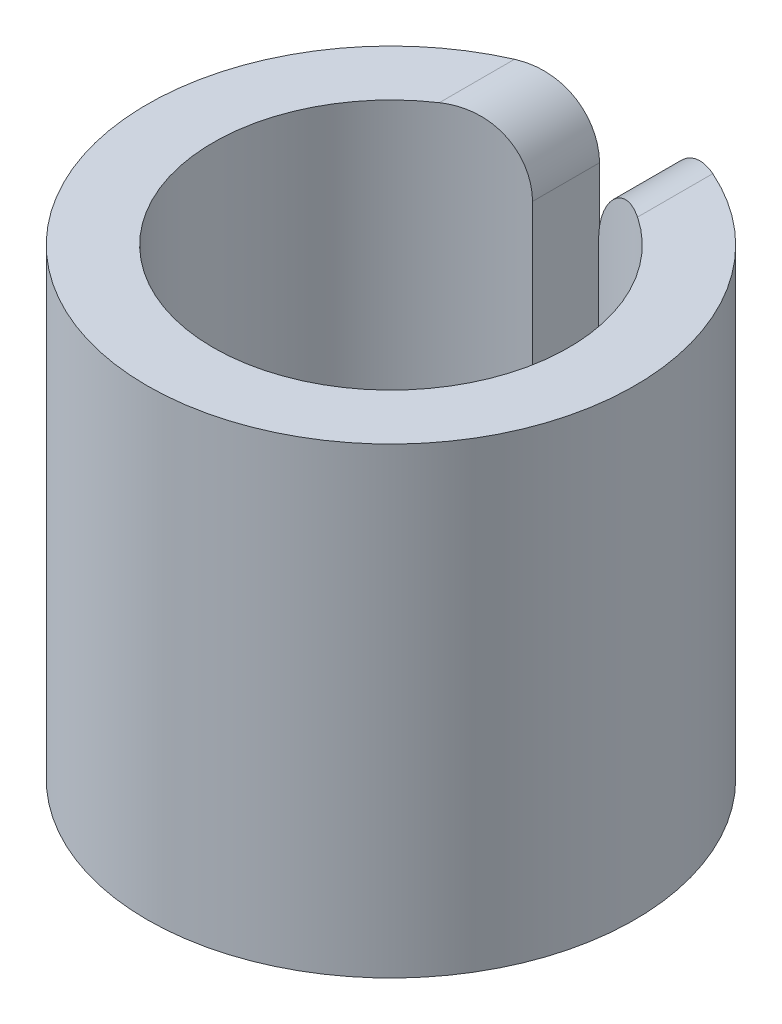
ISO-10303-21;
HEADER;
FILE_DESCRIPTION(('STEP AP214'),'2;1');
FILE_NAME('part.step','',(''),(''),'','','');
FILE_SCHEMA(('AUTOMOTIVE_DESIGN { 1 0 10303 214 1 1 1 1 }'));
ENDSEC;
DATA;
#1=APPLICATION_CONTEXT('core data for automotive mechanical design processes');
#2=APPLICATION_PROTOCOL_DEFINITION('international standard','automotive_design',2000,#1);
#3=PRODUCT_CONTEXT('',#1,'mechanical');
#4=PRODUCT('Part','Part','',(#3));
#5=PRODUCT_RELATED_PRODUCT_CATEGORY('part','',(#4));
#6=PRODUCT_DEFINITION_FORMATION('','',#4);
#7=PRODUCT_DEFINITION_CONTEXT('part definition',#1,'design');
#8=PRODUCT_DEFINITION('design','',#6,#7);
#9=PRODUCT_DEFINITION_SHAPE('','',#8);
#10=(LENGTH_UNIT() NAMED_UNIT(*) SI_UNIT(.MILLI.,.METRE.));
#11=(NAMED_UNIT(*) PLANE_ANGLE_UNIT() SI_UNIT($,.RADIAN.));
#12=(NAMED_UNIT(*) SI_UNIT($,.STERADIAN.) SOLID_ANGLE_UNIT());
#13=UNCERTAINTY_MEASURE_WITH_UNIT(LENGTH_MEASURE(1.E-05),#10,'distance_accuracy_value','');
#14=(GEOMETRIC_REPRESENTATION_CONTEXT(3) GLOBAL_UNCERTAINTY_ASSIGNED_CONTEXT((#13)) GLOBAL_UNIT_ASSIGNED_CONTEXT((#10,
#11,#12)) REPRESENTATION_CONTEXT('',''));
#15=CARTESIAN_POINT('',(0.,0.,0.));
#16=DIRECTION('',(0.,0.,1.));
#17=DIRECTION('',(1.,0.,0.));
#18=AXIS2_PLACEMENT_3D('',#15,#16,#17);
#19=CARTESIAN_POINT('',(0.,3.5,0.));
#20=DIRECTION('',(0.,1.,0.));
#21=DIRECTION('',(0.,0.,1.));
#22=AXIS2_PLACEMENT_3D('',#19,#20,#21);
#23=PLANE('',#22);
#24=CARTESIAN_POINT('',(0.,3.5,0.));
#25=DIRECTION('',(0.,1.,0.));
#26=DIRECTION('',(1.,0.,0.));
#27=AXIS2_PLACEMENT_3D('',#24,#25,#26);
#28=CIRCLE('',#27,3.69);
#29=CARTESIAN_POINT('',(-1.50000000000031,3.5,-3.37136470883811));
#30=VERTEX_POINT('',#29);
#31=CARTESIAN_POINT('',(1.5000000000003,3.5,-3.37136470883811));
#32=VERTEX_POINT('',#31);
#33=EDGE_CURVE('E227',#30,#32,#28,.T.);
#34=ORIENTED_EDGE('',*,*,#33,.T.);
#35=DIRECTION('',(0.,0.,-1.));
#36=VECTOR('',#35,1.);
#37=CARTESIAN_POINT('',(1.5000000000003,3.5,-2.64312315263586));
#38=LINE('',#37,#36);
#39=CARTESIAN_POINT('',(1.5000000000003,3.5,-2.23295767984955));
#40=VERTEX_POINT('',#39);
#41=EDGE_CURVE('E137',#32,#40,#38,.F.);
#42=ORIENTED_EDGE('',*,*,#41,.T.);
#43=CARTESIAN_POINT('',(0.,3.5,0.));
#44=DIRECTION('',(0.,1.,0.));
#45=DIRECTION('',(0.,0.,1.));
#46=AXIS2_PLACEMENT_3D('',#43,#44,#45);
#47=CIRCLE('',#46,2.69);
#48=CARTESIAN_POINT('',(-1.50000000000031,3.5,-2.23295767984955));
#49=VERTEX_POINT('',#48);
#50=EDGE_CURVE('E231',#49,#40,#47,.T.);
#51=ORIENTED_EDGE('',*,*,#50,.F.);
#52=DIRECTION('',(0.,0.,1.));
#53=VECTOR('',#52,1.);
#54=CARTESIAN_POINT('',(-1.50000000000031,3.5,-3.65596772414633));
#55=LINE('',#54,#53);
#56=EDGE_CURVE('E143',#49,#30,#55,.F.);
#57=ORIENTED_EDGE('',*,*,#56,.T.);
#58=EDGE_LOOP('',(#34,#42,#51,#57));
#59=FACE_BOUND('',#58,.T.);
#60=ADVANCED_FACE('F42',(#59),#23,.T.);
#61=CARTESIAN_POINT('',(0.,-3.5,0.));
#62=DIRECTION('',(0.,1.,0.));
#63=DIRECTION('',(0.,0.,1.));
#64=AXIS2_PLACEMENT_3D('',#61,#62,#63);
#65=PLANE('',#64);
#66=CARTESIAN_POINT('',(0.,-3.5,0.));
#67=DIRECTION('',(0.,1.,0.));
#68=DIRECTION('',(1.,0.,0.));
#69=AXIS2_PLACEMENT_3D('',#66,#67,#68);
#70=CIRCLE('',#69,3.69);
#71=CARTESIAN_POINT('',(-1.50000000000031,-3.5,-3.37136470883811));
#72=VERTEX_POINT('',#71);
#73=CARTESIAN_POINT('',(1.5000000000003,-3.5,-3.37136470883811));
#74=VERTEX_POINT('',#73);
#75=EDGE_CURVE('E228',#72,#74,#70,.T.);
#76=ORIENTED_EDGE('',*,*,#75,.F.);
#77=DIRECTION('',(0.,0.,1.));
#78=VECTOR('',#77,1.);
#79=CARTESIAN_POINT('',(-1.50000000000031,-3.5,0.));
#80=LINE('',#79,#78);
#81=CARTESIAN_POINT('',(-1.50000000000031,-3.5,-2.23295767984955));
#82=VERTEX_POINT('',#81);
#83=EDGE_CURVE('E12',#72,#82,#80,.T.);
#84=ORIENTED_EDGE('',*,*,#83,.T.);
#85=CARTESIAN_POINT('',(0.,-3.5,0.));
#86=DIRECTION('',(0.,1.,0.));
#87=DIRECTION('',(0.,0.,1.));
#88=AXIS2_PLACEMENT_3D('',#85,#86,#87);
#89=CIRCLE('',#88,2.69);
#90=CARTESIAN_POINT('',(1.5000000000003,-3.5,-2.23295767984955));
#91=VERTEX_POINT('',#90);
#92=EDGE_CURVE('E235',#82,#91,#89,.T.);
#93=ORIENTED_EDGE('',*,*,#92,.T.);
#94=DIRECTION('',(0.,0.,-1.));
#95=VECTOR('',#94,1.);
#96=CARTESIAN_POINT('',(1.50000000000031,-3.5,0.));
#97=LINE('',#96,#95);
#98=EDGE_CURVE('E52',#91,#74,#97,.T.);
#99=ORIENTED_EDGE('',*,*,#98,.T.);
#100=EDGE_LOOP('',(#76,#84,#93,#99));
#101=FACE_BOUND('',#100,.T.);
#102=ADVANCED_FACE('F211',(#101),#65,.F.);
#103=CARTESIAN_POINT('',(0.,3.5,0.));
#104=DIRECTION('',(0.,-1.,0.));
#105=DIRECTION('',(0.,0.,-1.));
#106=AXIS2_PLACEMENT_3D('',#103,#104,#105);
#107=CYLINDRICAL_SURFACE('',#106,3.69);
#108=DIRECTION('',(0.,-1.,0.));
#109=VECTOR('',#108,1.);
#110=CARTESIAN_POINT('',(0.500000000000304,3.5,-3.65596772414633));
#111=LINE('',#110,#109);
#112=CARTESIAN_POINT('',(0.500000000000304,-2.5,-3.65596772414633));
#113=VERTEX_POINT('',#112);
#114=CARTESIAN_POINT('',(0.500000000000304,2.5,-3.65596772414633));
#115=VERTEX_POINT('',#114);
#116=EDGE_CURVE('E119',#113,#115,#111,.F.);
#117=ORIENTED_EDGE('',*,*,#116,.T.);
#118=CARTESIAN_POINT('',(0.500000000000304,2.5,-3.65596772414633));
#119=CARTESIAN_POINT('',(0.500000082817128,2.52781308003016,-3.65596589444756));
#120=CARTESIAN_POINT('',(0.501161105023619,2.55561289754367,-3.65580913444034));
#121=CARTESIAN_POINT('',(0.505792187211567,2.6110148931079,-3.65517199456636));
#122=CARTESIAN_POINT('',(0.50926217660817,2.63861707717418,-3.65469162459231));
#123=CARTESIAN_POINT('',(0.523102806023595,2.72079211858252,-3.65274636491329));
#124=CARTESIAN_POINT('',(0.536904193141292,2.77481659287134,-3.65077739985674));
#125=CARTESIAN_POINT('',(0.573247241827748,2.87976144457652,-3.64524643417263));
#126=CARTESIAN_POINT('',(0.595794067371662,2.93067996740592,-3.64168349214823));
#127=CARTESIAN_POINT('',(0.648916993247099,3.02794443270229,-3.63259271768315));
#128=CARTESIAN_POINT('',(0.679491276005795,3.07429140699323,-3.62706532993124));
#129=CARTESIAN_POINT('',(0.747538941507797,3.16092764397699,-3.61365181736284));
#130=CARTESIAN_POINT('',(0.784985584494407,3.20123932206504,-3.6057747630603));
#131=CARTESIAN_POINT('',(0.86558425601745,3.27491725667402,-3.58727877515535));
#132=CARTESIAN_POINT('',(0.908735294516107,3.30828471583168,-3.5766603170387));
#133=CARTESIAN_POINT('',(0.999193522604081,3.36723924266644,-3.55244956037333));
#134=CARTESIAN_POINT('',(1.04649411359834,3.39283838441752,-3.53886193385552));
#135=CARTESIAN_POINT('',(1.14377324755107,3.43591339166262,-3.50862903091158));
#136=CARTESIAN_POINT('',(1.1937533511762,3.45338446440442,-3.49198195851895));
#137=CARTESIAN_POINT('',(1.28669550289056,3.47797157474241,-3.45869061170086));
#138=CARTESIAN_POINT('',(1.3294987111058,3.48629834377232,-3.44247338148098));
#139=CARTESIAN_POINT('',(1.41499714517253,3.4973139193632,-3.40823040303336));
#140=CARTESIAN_POINT('',(1.45769239463773,3.50001554219229,-3.39020886421097));
#141=CARTESIAN_POINT('',(1.5000000000003,3.5,-3.37136470883811));
#142=B_SPLINE_CURVE_WITH_KNOTS('',3,(#118,#119,#120,#121,#122,#123,#124,#125,#126,#127,#128,
#129,#130,#131,#132,#133,#134,#135,#136,#137,#138,#139,#140,#141),.UNSPECIFIED.,.F.,.F.,(4,2,2,
2,2,2,2,2,2,2,2,4),(0.,0.0833881928345898,0.166773836619071,0.33329890321556,0.499922448993869,
0.666508300438434,0.832459217659524,0.998381370658126,1.16404429891574,1.32980478763568,
1.46900232215449,1.60788236202148),.UNSPECIFIED.);
#143=EDGE_CURVE('E198',#115,#32,#142,.T.);
#144=ORIENTED_EDGE('',*,*,#143,.T.);
#145=ORIENTED_EDGE('',*,*,#33,.F.);
#146=CARTESIAN_POINT('',(-1.50000000000031,3.5,-3.37136470883811));
#147=CARTESIAN_POINT('',(-1.47283124298569,3.49999911402014,-3.38345442984184));
#148=CARTESIAN_POINT('',(-1.44552337566981,3.49889177376586,-3.39520865002755));
#149=CARTESIAN_POINT('',(-1.39078220506359,3.49439800416099,-3.41799695761536));
#150=CARTESIAN_POINT('',(-1.36334885324912,3.49101060313515,-3.42903073579233));
#151=CARTESIAN_POINT('',(-1.28108333169826,3.47732339670899,-3.4609787511372));
#152=CARTESIAN_POINT('',(-1.22632751721839,3.46349838659932,-3.48072111622429));
#153=CARTESIAN_POINT('',(-1.11880038559413,3.42624830983785,-3.51676237348628));
#154=CARTESIAN_POINT('',(-1.06603529477733,3.40279547467992,-3.53305109688307));
#155=CARTESIAN_POINT('',(-0.964681452839087,3.34663014332049,-3.56205915549299));
#156=CARTESIAN_POINT('',(-0.91608709375197,3.31393034314585,-3.57478333744522));
#157=CARTESIAN_POINT('',(-0.827434063685409,3.24211299988178,-3.59630721396851));
#158=CARTESIAN_POINT('',(-0.787054004133002,3.20344399168274,-3.60528341577583));
#159=CARTESIAN_POINT('',(-0.713091469623131,3.11959659706418,-3.62063960903582));
#160=CARTESIAN_POINT('',(-0.679511640998017,3.0744156881796,-3.62701859074379));
#161=CARTESIAN_POINT('',(-0.620941115192489,2.97988048549831,-3.63749948407966));
#162=CARTESIAN_POINT('',(-0.595786449806398,2.93063241244919,-3.64164595484003));
#163=CARTESIAN_POINT('',(-0.553917903150092,2.82858167000932,-3.64824978499721));
#164=CARTESIAN_POINT('',(-0.537198866652182,2.77578119399971,-3.65070817635475));
#165=CARTESIAN_POINT('',(-0.516660421431358,2.68557832345602,-3.6536601325258));
#166=CARTESIAN_POINT('',(-0.510417633291857,2.64872065017259,-3.65453204876113));
#167=CARTESIAN_POINT('',(-0.502087280502385,2.57458021975313,-3.65568230067327));
#168=CARTESIAN_POINT('',(-0.499994096884805,2.53729810629023,-3.65596143906539));
#169=CARTESIAN_POINT('',(-0.500000000000306,2.5,-3.65596772414633));
#170=B_SPLINE_CURVE_WITH_KNOTS('',3,(#146,#147,#148,#149,#150,#151,#152,#153,#154,#155,#156,
#157,#158,#159,#160,#161,#162,#163,#164,#165,#166,#167,#168,#169),.UNSPECIFIED.,.F.,.F.,(4,2,2,
2,2,2,2,2,2,2,2,4),(0.,0.0891673504576794,0.178372724729981,0.356919087446533,0.535984071296006,
0.714804383854775,0.883849602199933,1.05296047916786,1.21855755873119,1.38405331475116,
1.49600844207335,1.60781186744674),.UNSPECIFIED.);
#171=CARTESIAN_POINT('',(-0.500000000000306,2.5,-3.65596772414633));
#172=VERTEX_POINT('',#171);
#173=EDGE_CURVE('E190',#30,#172,#170,.T.);
#174=ORIENTED_EDGE('',*,*,#173,.T.);
#175=DIRECTION('',(0.,-1.,0.));
#176=VECTOR('',#175,1.);
#177=CARTESIAN_POINT('',(-0.500000000000306,3.5,-3.65596772414633));
#178=LINE('',#177,#176);
#179=CARTESIAN_POINT('',(-0.500000000000306,-2.5,-3.65596772414633));
#180=VERTEX_POINT('',#179);
#181=EDGE_CURVE('E242',#172,#180,#178,.T.);
#182=ORIENTED_EDGE('',*,*,#181,.T.);
#183=CARTESIAN_POINT('',(-0.500000000000306,-2.5,-3.65596772414633));
#184=CARTESIAN_POINT('',(-0.50000008281713,-2.52781308003016,-3.65596589444755));
#185=CARTESIAN_POINT('',(-0.501161105023621,-2.55561289754367,-3.65580913444034));
#186=CARTESIAN_POINT('',(-0.505792187211569,-2.6110148931079,-3.65517199456636));
#187=CARTESIAN_POINT('',(-0.509262176608172,-2.63861707717418,-3.6546916245923));
#188=CARTESIAN_POINT('',(-0.523102806023597,-2.72079211858252,-3.65274636491329));
#189=CARTESIAN_POINT('',(-0.536904193141294,-2.77481659287134,-3.65077739985674));
#190=CARTESIAN_POINT('',(-0.57324724182775,-2.87976144457652,-3.64524643417262));
#191=CARTESIAN_POINT('',(-0.595794067371664,-2.93067996740592,-3.64168349214823));
#192=CARTESIAN_POINT('',(-0.648916993247101,-3.02794443270229,-3.63259271768315));
#193=CARTESIAN_POINT('',(-0.679491276005797,-3.07429140699323,-3.62706532993124));
#194=CARTESIAN_POINT('',(-0.747538941507798,-3.16092764397699,-3.61365181736284));
#195=CARTESIAN_POINT('',(-0.78498558449441,-3.20123932206504,-3.6057747630603));
#196=CARTESIAN_POINT('',(-0.865584256017452,-3.27491725667402,-3.58727877515535));
#197=CARTESIAN_POINT('',(-0.908735294516109,-3.30828471583168,-3.5766603170387));
#198=CARTESIAN_POINT('',(-0.999193522604083,-3.36723924266644,-3.55244956037333));
#199=CARTESIAN_POINT('',(-1.04649411359834,-3.39283838441752,-3.53886193385552));
#200=CARTESIAN_POINT('',(-1.14377324755107,-3.43591339166262,-3.50862903091158));
#201=CARTESIAN_POINT('',(-1.19375335117621,-3.45338446440442,-3.49198195851895));
#202=CARTESIAN_POINT('',(-1.28669550289056,-3.47797157474241,-3.45869061170086));
#203=CARTESIAN_POINT('',(-1.3294987111058,-3.48629834377232,-3.44247338148098));
#204=CARTESIAN_POINT('',(-1.41499714517254,-3.4973139193632,-3.40823040303336));
#205=CARTESIAN_POINT('',(-1.45769239463774,-3.50001554219229,-3.39020886421097));
#206=CARTESIAN_POINT('',(-1.50000000000031,-3.5,-3.37136470883811));
#207=B_SPLINE_CURVE_WITH_KNOTS('',3,(#183,#184,#185,#186,#187,#188,#189,#190,#191,#192,#193,
#194,#195,#196,#197,#198,#199,#200,#201,#202,#203,#204,#205,#206),.UNSPECIFIED.,.F.,.F.,(4,2,2,
2,2,2,2,2,2,2,2,4),(0.,0.0833881928345898,0.166773836619071,0.33329890321556,0.499922448993869,
0.666508300438434,0.832459217659524,0.998381370658126,1.16404429891574,1.32980478763568,
1.46900232215449,1.60788236202148),.UNSPECIFIED.);
#208=EDGE_CURVE('E199',#180,#72,#207,.T.);
#209=ORIENTED_EDGE('',*,*,#208,.T.);
#210=ORIENTED_EDGE('',*,*,#75,.T.);
#211=CARTESIAN_POINT('',(1.5000000000003,-3.5,-3.37136470883811));
#212=CARTESIAN_POINT('',(1.47283124298569,-3.49999911402014,-3.38345442984184));
#213=CARTESIAN_POINT('',(1.4455233756698,-3.49889177376586,-3.39520865002755));
#214=CARTESIAN_POINT('',(1.39078220506359,-3.49439800416099,-3.41799695761536));
#215=CARTESIAN_POINT('',(1.36334885324912,-3.49101060313515,-3.42903073579233));
#216=CARTESIAN_POINT('',(1.28108333169826,-3.47732339670899,-3.4609787511372));
#217=CARTESIAN_POINT('',(1.22632751721839,-3.46349838659932,-3.48072111622429));
#218=CARTESIAN_POINT('',(1.11880038559413,-3.42624830983785,-3.51676237348628));
#219=CARTESIAN_POINT('',(1.06603529477733,-3.40279547467992,-3.53305109688307));
#220=CARTESIAN_POINT('',(0.964681452839084,-3.34663014332049,-3.56205915549299));
#221=CARTESIAN_POINT('',(0.916087093751967,-3.31393034314585,-3.57478333744522));
#222=CARTESIAN_POINT('',(0.827434063685406,-3.24211299988178,-3.59630721396851));
#223=CARTESIAN_POINT('',(0.787054004133,-3.20344399168274,-3.60528341577583));
#224=CARTESIAN_POINT('',(0.713091469623128,-3.11959659706418,-3.62063960903582));
#225=CARTESIAN_POINT('',(0.679511640998014,-3.0744156881796,-3.62701859074379));
#226=CARTESIAN_POINT('',(0.620941115192486,-2.97988048549831,-3.63749948407966));
#227=CARTESIAN_POINT('',(0.595786449806395,-2.93063241244919,-3.64164595484003));
#228=CARTESIAN_POINT('',(0.55391790315009,-2.82858167000932,-3.64824978499722));
#229=CARTESIAN_POINT('',(0.53719886665218,-2.77578119399971,-3.65070817635475));
#230=CARTESIAN_POINT('',(0.516660421431356,-2.68557832345602,-3.6536601325258));
#231=CARTESIAN_POINT('',(0.510417633291854,-2.64872065017259,-3.65453204876113));
#232=CARTESIAN_POINT('',(0.502087280502383,-2.57458021975313,-3.65568230067327));
#233=CARTESIAN_POINT('',(0.499994096884802,-2.53729810629023,-3.65596143906539));
#234=CARTESIAN_POINT('',(0.500000000000304,-2.5,-3.65596772414633));
#235=B_SPLINE_CURVE_WITH_KNOTS('',3,(#211,#212,#213,#214,#215,#216,#217,#218,#219,#220,#221,
#222,#223,#224,#225,#226,#227,#228,#229,#230,#231,#232,#233,#234),.UNSPECIFIED.,.F.,.F.,(4,2,2,
2,2,2,2,2,2,2,2,4),(0.,0.0891673504576795,0.178372724729981,0.356919087446533,0.535984071296007,
0.714804383854775,0.883849602199935,1.05296047916786,1.21855755873119,1.38405331475116,
1.49600844207335,1.60781186744674),.UNSPECIFIED.);
#236=EDGE_CURVE('E215',#74,#113,#235,.T.);
#237=ORIENTED_EDGE('',*,*,#236,.T.);
#238=EDGE_LOOP('',(#117,#144,#145,#174,#182,#209,#210,#237));
#239=FACE_BOUND('',#238,.T.);
#240=ADVANCED_FACE('F161',(#239),#107,.T.);
#241=CARTESIAN_POINT('',(0.,3.5,0.));
#242=DIRECTION('',(0.,-1.,0.));
#243=DIRECTION('',(0.,0.,-1.));
#244=AXIS2_PLACEMENT_3D('',#241,#242,#243);
#245=CYLINDRICAL_SURFACE('',#244,2.69);
#246=ORIENTED_EDGE('',*,*,#50,.T.);
#247=CARTESIAN_POINT('',(1.5000000000003,3.5,-2.23295767984955));
#248=CARTESIAN_POINT('',(1.47393017245271,3.49999837185871,-2.25047229639951));
#249=CARTESIAN_POINT('',(1.4475565465579,3.49897936173474,-2.26752320903815));
#250=CARTESIAN_POINT('',(1.39433612973415,3.4947613634631,-2.30063243814991));
#251=CARTESIAN_POINT('',(1.36748896798295,3.49156058557811,-2.3166899278983));
#252=CARTESIAN_POINT('',(1.28633140054199,3.47844179563074,-2.36333159237758));
#253=CARTESIAN_POINT('',(1.23157410673629,3.46500543581051,-2.39227159524748));
#254=CARTESIAN_POINT('',(1.12275052799407,3.42790328059018,-2.44524384814602));
#255=CARTESIAN_POINT('',(1.06868931956647,3.40418463442944,-2.46924978447332));
#256=CARTESIAN_POINT('',(0.964210189226732,3.34644859446251,-2.51188659256823));
#257=CARTESIAN_POINT('',(0.913782941373829,3.31245881694278,-2.53053161922726));
#258=CARTESIAN_POINT('',(0.82408567349399,3.23901307178568,-2.56105340380737));
#259=CARTESIAN_POINT('',(0.784199692633862,3.20051565216095,-2.5734374843676));
#260=CARTESIAN_POINT('',(0.710953024800094,3.11684331726017,-2.59462969362012));
#261=CARTESIAN_POINT('',(0.67759622370264,3.07166445339456,-2.60343569613371));
#262=CARTESIAN_POINT('',(0.619928883414566,2.97789917424908,-2.61775475010274));
#263=CARTESIAN_POINT('',(0.59531424605856,2.9295165616392,-2.62338365396008));
#264=CARTESIAN_POINT('',(0.554202842875677,2.82924097563509,-2.63237608746749));
#265=CARTESIAN_POINT('',(0.537700860243294,2.7773502825837,-2.63574107343407));
#266=CARTESIAN_POINT('',(0.517043639393555,2.68767927175128,-2.63985630262082));
#267=CARTESIAN_POINT('',(0.510658370327382,2.65041759420553,-2.6410908595129));
#268=CARTESIAN_POINT('',(0.502135689193274,2.57544197441234,-2.64271915118247));
#269=CARTESIAN_POINT('',(0.499992832678376,2.53772867439844,-2.64311396368385));
#270=CARTESIAN_POINT('',(0.500000000000305,2.5,-2.64312315263585));
#271=B_SPLINE_CURVE_WITH_KNOTS('',3,(#247,#248,#249,#250,#251,#252,#253,#254,#255,#256,#257,
#258,#259,#260,#261,#262,#263,#264,#265,#266,#267,#268,#269,#270),.UNSPECIFIED.,.F.,.F.,(4,2,2,
2,2,2,2,2,2,2,2,4),(0.,0.0941813046709036,0.188439960824099,0.377561292895441,0.56766644979601,
0.757264946022282,0.926807579701084,1.09645081280762,1.25942444404575,1.4222931383074,
1.53553173147533,1.64862490686934),.UNSPECIFIED.);
#272=CARTESIAN_POINT('',(0.500000000000305,2.5,-2.64312315263585));
#273=VERTEX_POINT('',#272);
#274=EDGE_CURVE('E130',#40,#273,#271,.T.);
#275=ORIENTED_EDGE('',*,*,#274,.T.);
#276=DIRECTION('',(0.,-1.,0.));
#277=VECTOR('',#276,1.);
#278=CARTESIAN_POINT('',(0.500000000000305,3.5,-2.64312315263585));
#279=LINE('',#278,#277);
#280=CARTESIAN_POINT('',(0.500000000000305,-2.5,-2.64312315263585));
#281=VERTEX_POINT('',#280);
#282=EDGE_CURVE('E116',#281,#273,#279,.F.);
#283=ORIENTED_EDGE('',*,*,#282,.F.);
#284=CARTESIAN_POINT('',(0.500000000000305,-2.5,-2.64312315263585));
#285=CARTESIAN_POINT('',(0.499999995122989,-2.52752641471898,-2.64312070240151));
#286=CARTESIAN_POINT('',(0.501137315505936,-2.55503975914015,-2.64290828647739));
#287=CARTESIAN_POINT('',(0.505673252206333,-2.60987199602344,-2.64204511749369));
#288=CARTESIAN_POINT('',(0.509071833771749,-2.63719089146742,-2.64139437117056));
#289=CARTESIAN_POINT('',(0.522627557385167,-2.71853310444462,-2.63875933930659));
#290=CARTESIAN_POINT('',(0.536144756550798,-2.77201547033434,-2.63609234996875));
#291=CARTESIAN_POINT('',(0.571717509342946,-2.87591570021494,-2.62860528565428));
#292=CARTESIAN_POINT('',(0.593778947363309,-2.92633142447055,-2.62378372647858));
#293=CARTESIAN_POINT('',(0.645686230417958,-3.0226243918863,-2.61149335069047));
#294=CARTESIAN_POINT('',(0.675529935680731,-3.06850287780671,-2.6040252615518));
#295=CARTESIAN_POINT('',(0.74167779153173,-3.15410448595645,-2.5859576266356));
#296=CARTESIAN_POINT('',(0.777934574194954,-3.19386899400994,-2.57538068800575));
#297=CARTESIAN_POINT('',(0.855643284040086,-3.26657290192919,-2.55061418013613));
#298=CARTESIAN_POINT('',(0.89709283965185,-3.29951539934186,-2.53642625702236));
#299=CARTESIAN_POINT('',(0.983405901407139,-3.35780682869802,-2.50422097778695));
#300=CARTESIAN_POINT('',(1.02825539791942,-3.38318500161982,-2.4862188405357));
#301=CARTESIAN_POINT('',(1.11990018020859,-3.4263345739998,-2.44630866779017));
#302=CARTESIAN_POINT('',(1.16669830285675,-3.44409442515997,-2.4243947733282));
#303=CARTESIAN_POINT('',(1.26199229227113,-3.47257129877969,-2.3762160231098));
#304=CARTESIAN_POINT('',(1.31049854302437,-3.48307325874132,-2.34984499669727));
#305=CARTESIAN_POINT('',(1.38240270501298,-3.49335673795523,-2.30777751860136));
#306=CARTESIAN_POINT('',(1.40620225712125,-3.4958732166041,-2.29335394797589));
#307=CARTESIAN_POINT('',(1.45341420943893,-3.49919381627999,-2.26372775684788));
#308=CARTESIAN_POINT('',(1.47682683503502,-3.49999897174706,-2.24852561266321));
#309=CARTESIAN_POINT('',(1.50000000000031,-3.5,-2.23295767984955));
#310=B_SPLINE_CURVE_WITH_KNOTS('',3,(#284,#285,#286,#287,#288,#289,#290,#291,#292,#293,#294,
#295,#296,#297,#298,#299,#300,#301,#302,#303,#304,#305,#306,#307,#308,#309),.UNSPECIFIED.,.F.,
.F.,(4,2,2,2,2,2,2,2,2,2,2,2,4),(0.,0.0825289068692493,0.165056545428112,0.329894044555414,
0.494845269267519,0.659751187587478,0.823486409420319,0.987147123167073,1.15016672400751,
1.31343257366946,1.48134980638683,1.56512250073506,1.64884454275528),.UNSPECIFIED.);
#311=EDGE_CURVE('E127',#281,#91,#310,.T.);
#312=ORIENTED_EDGE('',*,*,#311,.T.);
#313=ORIENTED_EDGE('',*,*,#92,.F.);
#314=CARTESIAN_POINT('',(-1.50000000000031,-3.5,-2.23295767984955));
#315=CARTESIAN_POINT('',(-1.47393017245271,-3.49999837185871,-2.25047229639951));
#316=CARTESIAN_POINT('',(-1.44755654655791,-3.49897936173474,-2.26752320903815));
#317=CARTESIAN_POINT('',(-1.39433612973416,-3.4947613634631,-2.30063243814991));
#318=CARTESIAN_POINT('',(-1.36748896798295,-3.49156058557811,-2.3166899278983));
#319=CARTESIAN_POINT('',(-1.286331400542,-3.47844179563074,-2.36333159237758));
#320=CARTESIAN_POINT('',(-1.23157410673629,-3.46500543581051,-2.39227159524748));
#321=CARTESIAN_POINT('',(-1.12275052799407,-3.42790328059018,-2.44524384814602));
#322=CARTESIAN_POINT('',(-1.06868931956647,-3.40418463442944,-2.46924978447332));
#323=CARTESIAN_POINT('',(-0.964210189226734,-3.34644859446251,-2.51188659256823));
#324=CARTESIAN_POINT('',(-0.91378294137383,-3.31245881694278,-2.53053161922726));
#325=CARTESIAN_POINT('',(-0.824085673493992,-3.23901307178568,-2.56105340380737));
#326=CARTESIAN_POINT('',(-0.784199692633864,-3.20051565216095,-2.5734374843676));
#327=CARTESIAN_POINT('',(-0.710953024800095,-3.11684331726017,-2.59462969362012));
#328=CARTESIAN_POINT('',(-0.677596223702641,-3.07166445339456,-2.60343569613371));
#329=CARTESIAN_POINT('',(-0.619928883414567,-2.97789917424908,-2.61775475010274));
#330=CARTESIAN_POINT('',(-0.595314246058561,-2.9295165616392,-2.62338365396008));
#331=CARTESIAN_POINT('',(-0.554202842875679,-2.82924097563509,-2.63237608746749));
#332=CARTESIAN_POINT('',(-0.537700860243296,-2.7773502825837,-2.63574107343407));
#333=CARTESIAN_POINT('',(-0.517043639393557,-2.68767927175128,-2.63985630262082));
#334=CARTESIAN_POINT('',(-0.510658370327383,-2.65041759420553,-2.6410908595129));
#335=CARTESIAN_POINT('',(-0.502135689193276,-2.57544197441234,-2.64271915118247));
#336=CARTESIAN_POINT('',(-0.499992832678377,-2.53772867439844,-2.64311396368385));
#337=CARTESIAN_POINT('',(-0.500000000000306,-2.5,-2.64312315263585));
#338=B_SPLINE_CURVE_WITH_KNOTS('',3,(#314,#315,#316,#317,#318,#319,#320,#321,#322,#323,#324,
#325,#326,#327,#328,#329,#330,#331,#332,#333,#334,#335,#336,#337),.UNSPECIFIED.,.F.,.F.,(4,2,2,
2,2,2,2,2,2,2,2,4),(0.,0.0941813046709034,0.188439960824099,0.377561292895441,0.56766644979601,
0.757264946022282,0.926807579701084,1.09645081280762,1.25942444404575,1.4222931383074,
1.53553173147533,1.64862490686934),.UNSPECIFIED.);
#339=CARTESIAN_POINT('',(-0.500000000000306,-2.5,-2.64312315263585));
#340=VERTEX_POINT('',#339);
#341=EDGE_CURVE('E59',#82,#340,#338,.T.);
#342=ORIENTED_EDGE('',*,*,#341,.T.);
#343=DIRECTION('',(0.,-1.,0.));
#344=VECTOR('',#343,1.);
#345=CARTESIAN_POINT('',(-0.500000000000306,3.5,-2.64312315263585));
#346=LINE('',#345,#344);
#347=CARTESIAN_POINT('',(-0.500000000000306,2.5,-2.64312315263585));
#348=VERTEX_POINT('',#347);
#349=EDGE_CURVE('E132',#348,#340,#346,.T.);
#350=ORIENTED_EDGE('',*,*,#349,.F.);
#351=CARTESIAN_POINT('',(-0.500000000000306,2.5,-2.64312315263585));
#352=CARTESIAN_POINT('',(-0.49999999512299,2.52752641471898,-2.64312070240151));
#353=CARTESIAN_POINT('',(-0.501137315505937,2.55503975914015,-2.64290828647739));
#354=CARTESIAN_POINT('',(-0.505673252206334,2.60987199602344,-2.64204511749369));
#355=CARTESIAN_POINT('',(-0.509071833771751,2.63719089146742,-2.64139437117056));
#356=CARTESIAN_POINT('',(-0.522627557385169,2.71853310444462,-2.63875933930659));
#357=CARTESIAN_POINT('',(-0.536144756550799,2.77201547033434,-2.63609234996875));
#358=CARTESIAN_POINT('',(-0.571717509342947,2.87591570021494,-2.62860528565428));
#359=CARTESIAN_POINT('',(-0.59377894736331,2.92633142447054,-2.62378372647858));
#360=CARTESIAN_POINT('',(-0.645686230417959,3.0226243918863,-2.61149335069047));
#361=CARTESIAN_POINT('',(-0.675529935680733,3.06850287780671,-2.6040252615518));
#362=CARTESIAN_POINT('',(-0.741677791531732,3.15410448595645,-2.5859576266356));
#363=CARTESIAN_POINT('',(-0.777934574194956,3.19386899400994,-2.57538068800575));
#364=CARTESIAN_POINT('',(-0.855643284040089,3.26657290192919,-2.55061418013613));
#365=CARTESIAN_POINT('',(-0.897092839651852,3.29951539934186,-2.53642625702236));
#366=CARTESIAN_POINT('',(-0.983405901407141,3.35780682869802,-2.50422097778695));
#367=CARTESIAN_POINT('',(-1.02825539791942,3.38318500161982,-2.4862188405357));
#368=CARTESIAN_POINT('',(-1.11990018020859,3.4263345739998,-2.44630866779017));
#369=CARTESIAN_POINT('',(-1.16669830285676,3.44409442515997,-2.4243947733282));
#370=CARTESIAN_POINT('',(-1.26199229227114,3.47257129877969,-2.3762160231098));
#371=CARTESIAN_POINT('',(-1.31049854302438,3.48307325874132,-2.34984499669727));
#372=CARTESIAN_POINT('',(-1.38240270501298,3.49335673795523,-2.30777751860136));
#373=CARTESIAN_POINT('',(-1.40620225712125,3.4958732166041,-2.29335394797589));
#374=CARTESIAN_POINT('',(-1.45341420943893,3.49919381627999,-2.26372775684787));
#375=CARTESIAN_POINT('',(-1.47682683503502,3.49999897174706,-2.24852561266321));
#376=CARTESIAN_POINT('',(-1.50000000000031,3.5,-2.23295767984955));
#377=B_SPLINE_CURVE_WITH_KNOTS('',3,(#351,#352,#353,#354,#355,#356,#357,#358,#359,#360,#361,
#362,#363,#364,#365,#366,#367,#368,#369,#370,#371,#372,#373,#374,#375,#376),.UNSPECIFIED.,.F.,
.F.,(4,2,2,2,2,2,2,2,2,2,2,2,4),(0.,0.0825289068692492,0.165056545428113,0.329894044555415,
0.494845269267518,0.659751187587479,0.82348640942032,0.987147123167074,1.15016672400751,
1.31343257366946,1.48134980638683,1.56512250073506,1.64884454275528),.UNSPECIFIED.);
#378=EDGE_CURVE('E67',#348,#49,#377,.T.);
#379=ORIENTED_EDGE('',*,*,#378,.T.);
#380=EDGE_LOOP('',(#246,#275,#283,#312,#313,#342,#350,#379));
#381=FACE_BOUND('',#380,.T.);
#382=ADVANCED_FACE('F126',(#381),#245,.F.);
#383=CARTESIAN_POINT('',(-0.500000000000306,-3.5,0.));
#384=DIRECTION('',(-1.,0.,0.));
#385=DIRECTION('',(0.,0.,1.));
#386=AXIS2_PLACEMENT_3D('',#383,#384,#385);
#387=PLANE('',#386);
#388=ORIENTED_EDGE('',*,*,#181,.F.);
#389=DIRECTION('',(0.,0.,1.));
#390=VECTOR('',#389,1.);
#391=CARTESIAN_POINT('',(-0.500000000000306,2.5,-2.64312315263585));
#392=LINE('',#391,#390);
#393=EDGE_CURVE('E260',#172,#348,#392,.T.);
#394=ORIENTED_EDGE('',*,*,#393,.T.);
#395=ORIENTED_EDGE('',*,*,#349,.T.);
#396=DIRECTION('',(0.,0.,1.));
#397=VECTOR('',#396,1.);
#398=CARTESIAN_POINT('',(-0.500000000000306,-2.5,0.));
#399=LINE('',#398,#397);
#400=EDGE_CURVE('E256',#340,#180,#399,.F.);
#401=ORIENTED_EDGE('',*,*,#400,.T.);
#402=EDGE_LOOP('',(#388,#394,#395,#401));
#403=FACE_BOUND('',#402,.T.);
#404=ADVANCED_FACE('F160',(#403),#387,.F.);
#405=CARTESIAN_POINT('',(0.500000000000306,-3.5,0.));
#406=DIRECTION('',(1.,0.,0.));
#407=DIRECTION('',(0.,0.,-1.));
#408=AXIS2_PLACEMENT_3D('',#405,#406,#407);
#409=PLANE('',#408);
#410=ORIENTED_EDGE('',*,*,#282,.T.);
#411=DIRECTION('',(0.,0.,-1.));
#412=VECTOR('',#411,1.);
#413=CARTESIAN_POINT('',(0.500000000000304,2.5,-3.65596772414633));
#414=LINE('',#413,#412);
#415=EDGE_CURVE('E123',#273,#115,#414,.T.);
#416=ORIENTED_EDGE('',*,*,#415,.T.);
#417=ORIENTED_EDGE('',*,*,#116,.F.);
#418=DIRECTION('',(0.,0.,-1.));
#419=VECTOR('',#418,1.);
#420=CARTESIAN_POINT('',(0.500000000000306,-2.5,0.));
#421=LINE('',#420,#419);
#422=EDGE_CURVE('E112',#113,#281,#421,.F.);
#423=ORIENTED_EDGE('',*,*,#422,.T.);
#424=EDGE_LOOP('',(#410,#416,#417,#423));
#425=FACE_BOUND('',#424,.T.);
#426=ADVANCED_FACE('F114',(#425),#409,.F.);
#427=CARTESIAN_POINT('',(1.50000000000031,2.5,0.));
#428=DIRECTION('',(0.,0.,1.));
#429=DIRECTION('',(1.,0.,0.));
#430=AXIS2_PLACEMENT_3D('',#427,#428,#429);
#431=CYLINDRICAL_SURFACE('',#430,1.);
#432=ORIENTED_EDGE('',*,*,#274,.F.);
#433=ORIENTED_EDGE('',*,*,#41,.F.);
#434=ORIENTED_EDGE('',*,*,#143,.F.);
#435=ORIENTED_EDGE('',*,*,#415,.F.);
#436=EDGE_LOOP('',(#432,#433,#434,#435));
#437=FACE_BOUND('',#436,.T.);
#438=ADVANCED_FACE('F184',(#437),#431,.T.);
#439=CARTESIAN_POINT('',(-1.50000000000031,2.5,0.));
#440=DIRECTION('',(0.,0.,-1.));
#441=DIRECTION('',(-1.,0.,0.));
#442=AXIS2_PLACEMENT_3D('',#439,#440,#441);
#443=CYLINDRICAL_SURFACE('',#442,1.);
#444=ORIENTED_EDGE('',*,*,#173,.F.);
#445=ORIENTED_EDGE('',*,*,#56,.F.);
#446=ORIENTED_EDGE('',*,*,#378,.F.);
#447=ORIENTED_EDGE('',*,*,#393,.F.);
#448=EDGE_LOOP('',(#444,#445,#446,#447));
#449=FACE_BOUND('',#448,.T.);
#450=ADVANCED_FACE('F180',(#449),#443,.T.);
#451=CARTESIAN_POINT('',(-1.50000000000031,-2.5,0.));
#452=DIRECTION('',(0.,0.,1.));
#453=DIRECTION('',(1.,0.,0.));
#454=AXIS2_PLACEMENT_3D('',#451,#452,#453);
#455=CYLINDRICAL_SURFACE('',#454,1.);
#456=ORIENTED_EDGE('',*,*,#208,.F.);
#457=ORIENTED_EDGE('',*,*,#400,.F.);
#458=ORIENTED_EDGE('',*,*,#341,.F.);
#459=ORIENTED_EDGE('',*,*,#83,.F.);
#460=EDGE_LOOP('',(#456,#457,#458,#459));
#461=FACE_BOUND('',#460,.T.);
#462=ADVANCED_FACE('F183',(#461),#455,.T.);
#463=CARTESIAN_POINT('',(1.50000000000031,-2.5,0.));
#464=DIRECTION('',(0.,0.,-1.));
#465=DIRECTION('',(-1.,0.,0.));
#466=AXIS2_PLACEMENT_3D('',#463,#464,#465);
#467=CYLINDRICAL_SURFACE('',#466,1.);
#468=ORIENTED_EDGE('',*,*,#311,.F.);
#469=ORIENTED_EDGE('',*,*,#422,.F.);
#470=ORIENTED_EDGE('',*,*,#236,.F.);
#471=ORIENTED_EDGE('',*,*,#98,.F.);
#472=EDGE_LOOP('',(#468,#469,#470,#471));
#473=FACE_BOUND('',#472,.T.);
#474=ADVANCED_FACE('F44',(#473),#467,.T.);
#475=CLOSED_SHELL('',(#60,#102,#240,#382,#404,#426,#438,#450,#462,#474));
#476=MANIFOLD_SOLID_BREP('B2',#475);
#477=ADVANCED_BREP_SHAPE_REPRESENTATION('',(#18,#476),#14);
#478=SHAPE_DEFINITION_REPRESENTATION(#9,#477);
ENDSEC;
END-ISO-10303-21;
